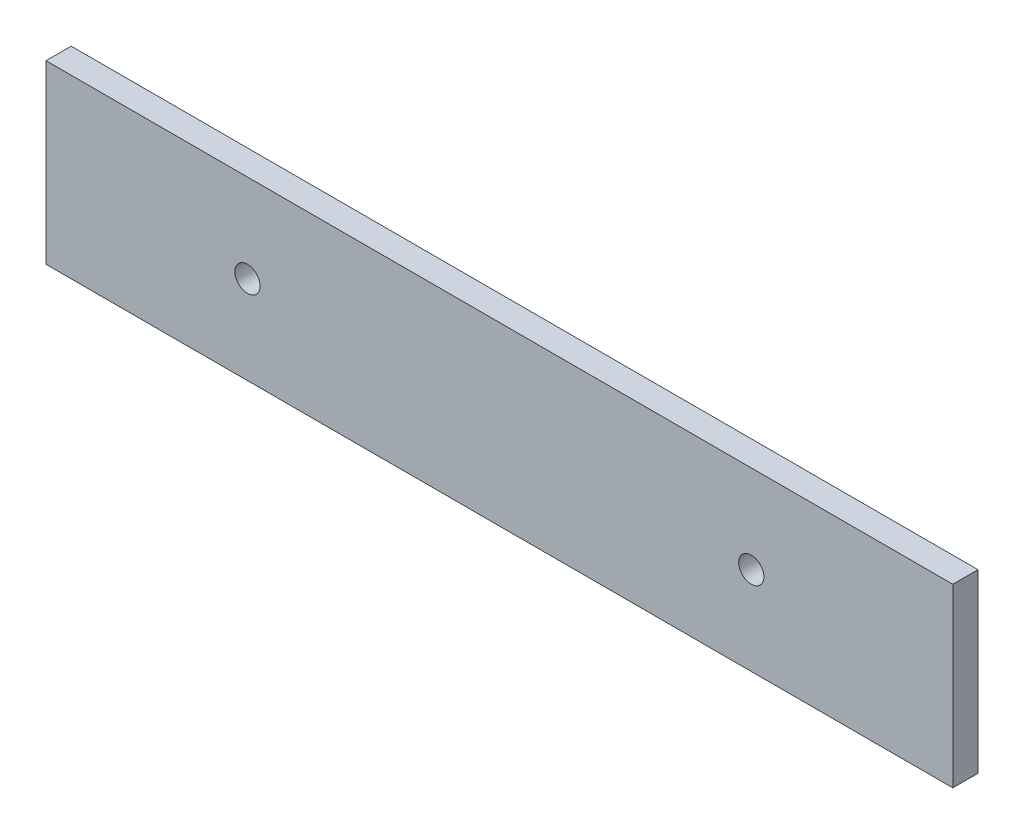
ISO-10303-21;
HEADER;
FILE_DESCRIPTION(('STEP AP214'),'2;1');
FILE_NAME('part.step','',(''),(''),'','','');
FILE_SCHEMA(('AUTOMOTIVE_DESIGN { 1 0 10303 214 1 1 1 1 }'));
ENDSEC;
DATA;
#1=APPLICATION_CONTEXT('core data for automotive mechanical design processes');
#2=APPLICATION_PROTOCOL_DEFINITION('international standard','automotive_design',2000,#1);
#3=PRODUCT_CONTEXT('',#1,'mechanical');
#4=PRODUCT('Part','Part','',(#3));
#5=PRODUCT_RELATED_PRODUCT_CATEGORY('part','',(#4));
#6=PRODUCT_DEFINITION_FORMATION('','',#4);
#7=PRODUCT_DEFINITION_CONTEXT('part definition',#1,'design');
#8=PRODUCT_DEFINITION('design','',#6,#7);
#9=PRODUCT_DEFINITION_SHAPE('','',#8);
#10=(LENGTH_UNIT() NAMED_UNIT(*) SI_UNIT(.MILLI.,.METRE.));
#11=(NAMED_UNIT(*) PLANE_ANGLE_UNIT() SI_UNIT($,.RADIAN.));
#12=(NAMED_UNIT(*) SI_UNIT($,.STERADIAN.) SOLID_ANGLE_UNIT());
#13=UNCERTAINTY_MEASURE_WITH_UNIT(LENGTH_MEASURE(1.E-05),#10,'distance_accuracy_value','');
#14=(GEOMETRIC_REPRESENTATION_CONTEXT(3) GLOBAL_UNCERTAINTY_ASSIGNED_CONTEXT((#13)) GLOBAL_UNIT_ASSIGNED_CONTEXT((#10,
#11,#12)) REPRESENTATION_CONTEXT('',''));
#15=CARTESIAN_POINT('',(0.,0.,0.));
#16=DIRECTION('',(0.,0.,1.));
#17=DIRECTION('',(1.,0.,0.));
#18=AXIS2_PLACEMENT_3D('',#15,#16,#17);
#19=CARTESIAN_POINT('',(0.,0.,10.));
#20=DIRECTION('',(0.,0.,-1.));
#21=DIRECTION('',(-1.,0.,0.));
#22=AXIS2_PLACEMENT_3D('',#19,#20,#21);
#23=PLANE('',#22);
#24=CARTESIAN_POINT('',(-427.002543810062,120.689655172414,10.));
#25=DIRECTION('',(0.,0.,1.));
#26=DIRECTION('',(1.,0.,0.));
#27=AXIS2_PLACEMENT_3D('',#24,#25,#26);
#28=CIRCLE('',#27,4.99999999999999);
#29=CARTESIAN_POINT('',(-422.002543810062,120.689655172414,10.));
#30=VERTEX_POINT('',#29);
#31=EDGE_CURVE('E100',#30,#30,#28,.T.);
#32=ORIENTED_EDGE('',*,*,#31,.F.);
#33=EDGE_LOOP('',(#32));
#34=FACE_BOUND('',#33,.T.);
#35=DIRECTION('',(0.,1.,0.));
#36=VECTOR('',#35,1.);
#37=CARTESIAN_POINT('',(-147.002543810062,155.689655172414,10.));
#38=LINE('',#37,#36);
#39=CARTESIAN_POINT('',(-147.002543810062,85.6896551724138,10.));
#40=VERTEX_POINT('',#39);
#41=CARTESIAN_POINT('',(-147.002543810062,155.689655172414,10.));
#42=VERTEX_POINT('',#41);
#43=EDGE_CURVE('E85',#40,#42,#38,.T.);
#44=ORIENTED_EDGE('',*,*,#43,.T.);
#45=DIRECTION('',(-1.,0.,0.));
#46=VECTOR('',#45,1.);
#47=CARTESIAN_POINT('',(-147.002543810062,155.689655172414,10.));
#48=LINE('',#47,#46);
#49=CARTESIAN_POINT('',(-507.002543810062,155.689655172414,10.));
#50=VERTEX_POINT('',#49);
#51=EDGE_CURVE('E80',#42,#50,#48,.T.);
#52=ORIENTED_EDGE('',*,*,#51,.T.);
#53=DIRECTION('',(0.,-1.,0.));
#54=VECTOR('',#53,1.);
#55=CARTESIAN_POINT('',(-507.002543810062,155.689655172414,10.));
#56=LINE('',#55,#54);
#57=CARTESIAN_POINT('',(-507.002543810062,85.6896551724138,10.));
#58=VERTEX_POINT('',#57);
#59=EDGE_CURVE('E83',#50,#58,#56,.T.);
#60=ORIENTED_EDGE('',*,*,#59,.T.);
#61=DIRECTION('',(1.,0.,0.));
#62=VECTOR('',#61,1.);
#63=CARTESIAN_POINT('',(-147.002543810062,85.6896551724138,10.));
#64=LINE('',#63,#62);
#65=EDGE_CURVE('E50',#58,#40,#64,.T.);
#66=ORIENTED_EDGE('',*,*,#65,.T.);
#67=EDGE_LOOP('',(#44,#52,#60,#66));
#68=FACE_BOUND('',#67,.T.);
#69=CARTESIAN_POINT('',(-227.002543810062,120.689655172414,10.));
#70=DIRECTION('',(0.,0.,1.));
#71=DIRECTION('',(1.,0.,0.));
#72=AXIS2_PLACEMENT_3D('',#69,#70,#71);
#73=CIRCLE('',#72,4.99999999999999);
#74=CARTESIAN_POINT('',(-222.002543810062,120.689655172414,10.));
#75=VERTEX_POINT('',#74);
#76=EDGE_CURVE('E115',#75,#75,#73,.T.);
#77=ORIENTED_EDGE('',*,*,#76,.F.);
#78=EDGE_LOOP('',(#77));
#79=FACE_BOUND('',#78,.T.);
#80=ADVANCED_FACE('F33',(#34,#68,#79),#23,.F.);
#81=CARTESIAN_POINT('',(0.,0.,0.));
#82=DIRECTION('',(0.,0.,-1.));
#83=DIRECTION('',(-1.,0.,0.));
#84=AXIS2_PLACEMENT_3D('',#81,#82,#83);
#85=PLANE('',#84);
#86=CARTESIAN_POINT('',(-427.002543810062,120.689655172414,0.));
#87=DIRECTION('',(0.,0.,1.));
#88=DIRECTION('',(1.,0.,0.));
#89=AXIS2_PLACEMENT_3D('',#86,#87,#88);
#90=CIRCLE('',#89,4.99999999999999);
#91=CARTESIAN_POINT('',(-422.002543810062,120.689655172414,0.));
#92=VERTEX_POINT('',#91);
#93=EDGE_CURVE('E112',#92,#92,#90,.T.);
#94=ORIENTED_EDGE('',*,*,#93,.T.);
#95=EDGE_LOOP('',(#94));
#96=FACE_BOUND('',#95,.T.);
#97=DIRECTION('',(0.,1.,0.));
#98=VECTOR('',#97,1.);
#99=CARTESIAN_POINT('',(-147.002543810062,155.689655172414,0.));
#100=LINE('',#99,#98);
#101=CARTESIAN_POINT('',(-147.002543810062,85.6896551724138,0.));
#102=VERTEX_POINT('',#101);
#103=CARTESIAN_POINT('',(-147.002543810062,155.689655172414,0.));
#104=VERTEX_POINT('',#103);
#105=EDGE_CURVE('E97',#102,#104,#100,.T.);
#106=ORIENTED_EDGE('',*,*,#105,.F.);
#107=DIRECTION('',(1.,0.,0.));
#108=VECTOR('',#107,1.);
#109=CARTESIAN_POINT('',(-147.002543810062,85.6896551724138,0.));
#110=LINE('',#109,#108);
#111=CARTESIAN_POINT('',(-507.002543810062,85.6896551724138,0.));
#112=VERTEX_POINT('',#111);
#113=EDGE_CURVE('E73',#112,#102,#110,.T.);
#114=ORIENTED_EDGE('',*,*,#113,.F.);
#115=DIRECTION('',(0.,-1.,0.));
#116=VECTOR('',#115,1.);
#117=CARTESIAN_POINT('',(-507.002543810062,155.689655172414,0.));
#118=LINE('',#117,#116);
#119=CARTESIAN_POINT('',(-507.002543810062,155.689655172414,0.));
#120=VERTEX_POINT('',#119);
#121=EDGE_CURVE('E67',#120,#112,#118,.T.);
#122=ORIENTED_EDGE('',*,*,#121,.F.);
#123=DIRECTION('',(-1.,0.,0.));
#124=VECTOR('',#123,1.);
#125=CARTESIAN_POINT('',(-147.002543810062,155.689655172414,0.));
#126=LINE('',#125,#124);
#127=EDGE_CURVE('E89',#104,#120,#126,.T.);
#128=ORIENTED_EDGE('',*,*,#127,.F.);
#129=EDGE_LOOP('',(#106,#114,#122,#128));
#130=FACE_BOUND('',#129,.T.);
#131=CARTESIAN_POINT('',(-227.002543810062,120.689655172414,0.));
#132=DIRECTION('',(0.,0.,1.));
#133=DIRECTION('',(1.,0.,0.));
#134=AXIS2_PLACEMENT_3D('',#131,#132,#133);
#135=CIRCLE('',#134,4.99999999999999);
#136=CARTESIAN_POINT('',(-222.002543810062,120.689655172414,0.));
#137=VERTEX_POINT('',#136);
#138=EDGE_CURVE('E118',#137,#137,#135,.T.);
#139=ORIENTED_EDGE('',*,*,#138,.T.);
#140=EDGE_LOOP('',(#139));
#141=FACE_BOUND('',#140,.T.);
#142=ADVANCED_FACE('F108',(#96,#130,#141),#85,.T.);
#143=CARTESIAN_POINT('',(-147.002543810062,155.689655172414,10.));
#144=DIRECTION('',(-1.,0.,0.));
#145=DIRECTION('',(0.,-1.,0.));
#146=AXIS2_PLACEMENT_3D('',#143,#144,#145);
#147=PLANE('',#146);
#148=ORIENTED_EDGE('',*,*,#105,.T.);
#149=DIRECTION('',(0.,0.,-1.));
#150=VECTOR('',#149,1.);
#151=CARTESIAN_POINT('',(-147.002543810062,155.689655172414,10.));
#152=LINE('',#151,#150);
#153=EDGE_CURVE('E11',#42,#104,#152,.T.);
#154=ORIENTED_EDGE('',*,*,#153,.F.);
#155=ORIENTED_EDGE('',*,*,#43,.F.);
#156=DIRECTION('',(0.,0.,-1.));
#157=VECTOR('',#156,1.);
#158=CARTESIAN_POINT('',(-147.002543810062,85.6896551724138,10.));
#159=LINE('',#158,#157);
#160=EDGE_CURVE('E93',#40,#102,#159,.T.);
#161=ORIENTED_EDGE('',*,*,#160,.T.);
#162=EDGE_LOOP('',(#148,#154,#155,#161));
#163=FACE_BOUND('',#162,.T.);
#164=ADVANCED_FACE('F35',(#163),#147,.F.);
#165=CARTESIAN_POINT('',(-147.002543810062,155.689655172414,10.));
#166=DIRECTION('',(0.,-1.,0.));
#167=DIRECTION('',(0.,0.,-1.));
#168=AXIS2_PLACEMENT_3D('',#165,#166,#167);
#169=PLANE('',#168);
#170=ORIENTED_EDGE('',*,*,#127,.T.);
#171=DIRECTION('',(0.,0.,-1.));
#172=VECTOR('',#171,1.);
#173=CARTESIAN_POINT('',(-507.002543810062,155.689655172414,10.));
#174=LINE('',#173,#172);
#175=EDGE_CURVE('E42',#50,#120,#174,.T.);
#176=ORIENTED_EDGE('',*,*,#175,.F.);
#177=ORIENTED_EDGE('',*,*,#51,.F.);
#178=ORIENTED_EDGE('',*,*,#153,.T.);
#179=EDGE_LOOP('',(#170,#176,#177,#178));
#180=FACE_BOUND('',#179,.T.);
#181=ADVANCED_FACE('F88',(#180),#169,.F.);
#182=CARTESIAN_POINT('',(-507.002543810062,155.689655172414,10.));
#183=DIRECTION('',(1.,0.,0.));
#184=DIRECTION('',(0.,0.,-1.));
#185=AXIS2_PLACEMENT_3D('',#182,#183,#184);
#186=PLANE('',#185);
#187=ORIENTED_EDGE('',*,*,#121,.T.);
#188=DIRECTION('',(0.,0.,-1.));
#189=VECTOR('',#188,1.);
#190=CARTESIAN_POINT('',(-507.002543810062,85.6896551724138,10.));
#191=LINE('',#190,#189);
#192=EDGE_CURVE('E90',#58,#112,#191,.T.);
#193=ORIENTED_EDGE('',*,*,#192,.F.);
#194=ORIENTED_EDGE('',*,*,#59,.F.);
#195=ORIENTED_EDGE('',*,*,#175,.T.);
#196=EDGE_LOOP('',(#187,#193,#194,#195));
#197=FACE_BOUND('',#196,.T.);
#198=ADVANCED_FACE('F91',(#197),#186,.F.);
#199=CARTESIAN_POINT('',(-147.002543810062,85.6896551724138,10.));
#200=DIRECTION('',(0.,1.,0.));
#201=DIRECTION('',(-1.,0.,0.));
#202=AXIS2_PLACEMENT_3D('',#199,#200,#201);
#203=PLANE('',#202);
#204=ORIENTED_EDGE('',*,*,#113,.T.);
#205=ORIENTED_EDGE('',*,*,#160,.F.);
#206=ORIENTED_EDGE('',*,*,#65,.F.);
#207=ORIENTED_EDGE('',*,*,#192,.T.);
#208=EDGE_LOOP('',(#204,#205,#206,#207));
#209=FACE_BOUND('',#208,.T.);
#210=ADVANCED_FACE('F105',(#209),#203,.F.);
#211=CARTESIAN_POINT('',(-427.002543810062,120.689655172414,10.));
#212=DIRECTION('',(0.,0.,-1.));
#213=DIRECTION('',(-1.,0.,0.));
#214=AXIS2_PLACEMENT_3D('',#211,#212,#213);
#215=CYLINDRICAL_SURFACE('',#214,4.99999999999999);
#216=ORIENTED_EDGE('',*,*,#31,.T.);
#217=EDGE_LOOP('',(#216));
#218=FACE_BOUND('',#217,.T.);
#219=ORIENTED_EDGE('',*,*,#93,.F.);
#220=EDGE_LOOP('',(#219));
#221=FACE_BOUND('',#220,.T.);
#222=ADVANCED_FACE('F136',(#218,#221),#215,.F.);
#223=CARTESIAN_POINT('',(-227.002543810062,120.689655172414,10.));
#224=DIRECTION('',(0.,0.,-1.));
#225=DIRECTION('',(-1.,0.,0.));
#226=AXIS2_PLACEMENT_3D('',#223,#224,#225);
#227=CYLINDRICAL_SURFACE('',#226,4.99999999999999);
#228=ORIENTED_EDGE('',*,*,#76,.T.);
#229=EDGE_LOOP('',(#228));
#230=FACE_BOUND('',#229,.T.);
#231=ORIENTED_EDGE('',*,*,#138,.F.);
#232=EDGE_LOOP('',(#231));
#233=FACE_BOUND('',#232,.T.);
#234=ADVANCED_FACE('F124',(#230,#233),#227,.F.);
#235=CLOSED_SHELL('',(#80,#142,#164,#181,#198,#210,#222,#234));
#236=MANIFOLD_SOLID_BREP('B2',#235);
#237=ADVANCED_BREP_SHAPE_REPRESENTATION('',(#18,#236),#14);
#238=SHAPE_DEFINITION_REPRESENTATION(#9,#237);
ENDSEC;
END-ISO-10303-21;
